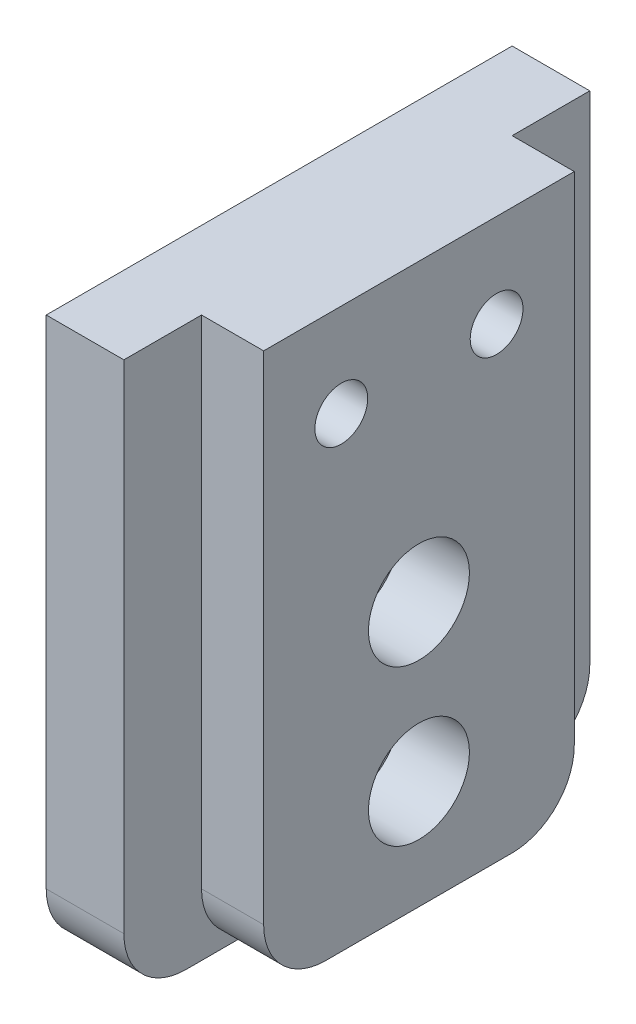
ISO-10303-21;
HEADER;
FILE_DESCRIPTION(('STEP AP214'),'2;1');
FILE_NAME('part.step','',(''),(''),'','','');
FILE_SCHEMA(('AUTOMOTIVE_DESIGN { 1 0 10303 214 1 1 1 1 }'));
ENDSEC;
DATA;
#1=APPLICATION_CONTEXT('core data for automotive mechanical design processes');
#2=APPLICATION_PROTOCOL_DEFINITION('international standard','automotive_design',2000,#1);
#3=PRODUCT_CONTEXT('',#1,'mechanical');
#4=PRODUCT('Part','Part','',(#3));
#5=PRODUCT_RELATED_PRODUCT_CATEGORY('part','',(#4));
#6=PRODUCT_DEFINITION_FORMATION('','',#4);
#7=PRODUCT_DEFINITION_CONTEXT('part definition',#1,'design');
#8=PRODUCT_DEFINITION('design','',#6,#7);
#9=PRODUCT_DEFINITION_SHAPE('','',#8);
#10=(LENGTH_UNIT() NAMED_UNIT(*) SI_UNIT(.MILLI.,.METRE.));
#11=(NAMED_UNIT(*) PLANE_ANGLE_UNIT() SI_UNIT($,.RADIAN.));
#12=(NAMED_UNIT(*) SI_UNIT($,.STERADIAN.) SOLID_ANGLE_UNIT());
#13=UNCERTAINTY_MEASURE_WITH_UNIT(LENGTH_MEASURE(1.E-05),#10,'distance_accuracy_value','');
#14=(GEOMETRIC_REPRESENTATION_CONTEXT(3) GLOBAL_UNCERTAINTY_ASSIGNED_CONTEXT((#13)) GLOBAL_UNIT_ASSIGNED_CONTEXT((#10,
#11,#12)) REPRESENTATION_CONTEXT('',''));
#15=CARTESIAN_POINT('',(0.,0.,0.));
#16=DIRECTION('',(0.,0.,1.));
#17=DIRECTION('',(1.,0.,0.));
#18=AXIS2_PLACEMENT_3D('',#15,#16,#17);
#19=CARTESIAN_POINT('',(0.,0.,0.));
#20=DIRECTION('',(1.,0.,0.));
#21=DIRECTION('',(0.,0.,-1.));
#22=AXIS2_PLACEMENT_3D('',#19,#20,#21);
#23=PLANE('',#22);
#24=DIRECTION('',(0.,1.,0.));
#25=VECTOR('',#24,1.);
#26=CARTESIAN_POINT('',(0.,-30.,-10.));
#27=LINE('',#26,#25);
#28=CARTESIAN_POINT('',(0.,-26.,-10.));
#29=VERTEX_POINT('',#28);
#30=CARTESIAN_POINT('',(0.,6.,-10.));
#31=VERTEX_POINT('',#30);
#32=EDGE_CURVE('E145',#29,#31,#27,.T.);
#33=ORIENTED_EDGE('',*,*,#32,.T.);
#34=DIRECTION('',(0.,0.,1.));
#35=VECTOR('',#34,1.);
#36=CARTESIAN_POINT('',(0.,6.,10.));
#37=LINE('',#36,#35);
#38=CARTESIAN_POINT('',(0.,6.,10.));
#39=VERTEX_POINT('',#38);
#40=EDGE_CURVE('E149',#31,#39,#37,.T.);
#41=ORIENTED_EDGE('',*,*,#40,.T.);
#42=DIRECTION('',(0.,1.,0.));
#43=VECTOR('',#42,1.);
#44=CARTESIAN_POINT('',(0.,-30.,10.));
#45=LINE('',#44,#43);
#46=CARTESIAN_POINT('',(0.,-26.,10.));
#47=VERTEX_POINT('',#46);
#48=EDGE_CURVE('E134',#47,#39,#45,.T.);
#49=ORIENTED_EDGE('',*,*,#48,.F.);
#50=CARTESIAN_POINT('',(0.,-26.,6.));
#51=DIRECTION('',(1.,0.,0.));
#52=DIRECTION('',(0.,0.,-1.));
#53=AXIS2_PLACEMENT_3D('',#50,#51,#52);
#54=CIRCLE('',#53,4.);
#55=CARTESIAN_POINT('',(0.,-30.,6.));
#56=VERTEX_POINT('',#55);
#57=EDGE_CURVE('E286',#47,#56,#54,.T.);
#58=ORIENTED_EDGE('',*,*,#57,.T.);
#59=DIRECTION('',(0.,0.,-1.));
#60=VECTOR('',#59,1.);
#61=CARTESIAN_POINT('',(0.,-30.,-10.));
#62=LINE('',#61,#60);
#63=CARTESIAN_POINT('',(0.,-30.,-6.));
#64=VERTEX_POINT('',#63);
#65=EDGE_CURVE('E172',#56,#64,#62,.T.);
#66=ORIENTED_EDGE('',*,*,#65,.T.);
#67=CARTESIAN_POINT('',(0.,-26.,-6.));
#68=DIRECTION('',(1.,0.,0.));
#69=DIRECTION('',(0.,0.,-1.));
#70=AXIS2_PLACEMENT_3D('',#67,#68,#69);
#71=CIRCLE('',#70,4.);
#72=EDGE_CURVE('E288',#64,#29,#71,.T.);
#73=ORIENTED_EDGE('',*,*,#72,.T.);
#74=EDGE_LOOP('',(#33,#41,#49,#58,#66,#73));
#75=FACE_BOUND('',#74,.T.);
#76=CARTESIAN_POINT('',(0.,0.,5.));
#77=DIRECTION('',(-1.,0.,0.));
#78=DIRECTION('',(0.,0.,1.));
#79=AXIS2_PLACEMENT_3D('',#76,#77,#78);
#80=CIRCLE('',#79,1.7);
#81=CARTESIAN_POINT('',(0.,0.,6.69999999999999));
#82=VERTEX_POINT('',#81);
#83=EDGE_CURVE('E157',#82,#82,#80,.T.);
#84=ORIENTED_EDGE('',*,*,#83,.T.);
#85=EDGE_LOOP('',(#84));
#86=FACE_BOUND('',#85,.T.);
#87=CARTESIAN_POINT('',(0.,0.,-5.));
#88=DIRECTION('',(-1.,0.,0.));
#89=DIRECTION('',(0.,0.,1.));
#90=AXIS2_PLACEMENT_3D('',#87,#88,#89);
#91=CIRCLE('',#90,1.7);
#92=CARTESIAN_POINT('',(0.,0.,-3.3));
#93=VERTEX_POINT('',#92);
#94=EDGE_CURVE('E45',#93,#93,#91,.T.);
#95=ORIENTED_EDGE('',*,*,#94,.T.);
#96=EDGE_LOOP('',(#95));
#97=FACE_BOUND('',#96,.T.);
#98=CARTESIAN_POINT('',(0.,-13.,0.));
#99=DIRECTION('',(1.,0.,0.));
#100=DIRECTION('',(0.,0.,-1.));
#101=AXIS2_PLACEMENT_3D('',#98,#99,#100);
#102=CIRCLE('',#101,3.25);
#103=CARTESIAN_POINT('',(0.,-13.,-3.25));
#104=VERTEX_POINT('',#103);
#105=EDGE_CURVE('E216',#104,#104,#102,.T.);
#106=ORIENTED_EDGE('',*,*,#105,.F.);
#107=EDGE_LOOP('',(#106));
#108=FACE_BOUND('',#107,.T.);
#109=CARTESIAN_POINT('',(0.,-23.,0.));
#110=DIRECTION('',(1.,0.,0.));
#111=DIRECTION('',(0.,0.,-1.));
#112=AXIS2_PLACEMENT_3D('',#109,#110,#111);
#113=CIRCLE('',#112,3.25);
#114=CARTESIAN_POINT('',(0.,-23.,-3.25));
#115=VERTEX_POINT('',#114);
#116=EDGE_CURVE('E204',#115,#115,#113,.T.);
#117=ORIENTED_EDGE('',*,*,#116,.F.);
#118=EDGE_LOOP('',(#117));
#119=FACE_BOUND('',#118,.T.);
#120=ADVANCED_FACE('F41',(#75,#86,#97,#108,#119),#23,.T.);
#121=CARTESIAN_POINT('',(0.,-23.,0.));
#122=DIRECTION('',(1.,0.,0.));
#123=DIRECTION('',(0.,0.,-1.));
#124=AXIS2_PLACEMENT_3D('',#121,#122,#123);
#125=CYLINDRICAL_SURFACE('',#124,1.7);
#126=CARTESIAN_POINT('',(-9.,-23.,0.));
#127=DIRECTION('',(1.,0.,0.));
#128=DIRECTION('',(0.,0.,-1.));
#129=AXIS2_PLACEMENT_3D('',#126,#127,#128);
#130=CIRCLE('',#129,1.7);
#131=CARTESIAN_POINT('',(-9.,-23.,-1.7));
#132=VERTEX_POINT('',#131);
#133=EDGE_CURVE('E195',#132,#132,#130,.T.);
#134=ORIENTED_EDGE('',*,*,#133,.F.);
#135=EDGE_LOOP('',(#134));
#136=FACE_BOUND('',#135,.T.);
#137=CARTESIAN_POINT('',(-4.5,-23.,0.));
#138=DIRECTION('',(1.,0.,0.));
#139=DIRECTION('',(0.,0.,-1.));
#140=AXIS2_PLACEMENT_3D('',#137,#138,#139);
#141=CIRCLE('',#140,1.7);
#142=CARTESIAN_POINT('',(-4.5,-23.,-1.7));
#143=VERTEX_POINT('',#142);
#144=EDGE_CURVE('E198',#143,#143,#141,.T.);
#145=ORIENTED_EDGE('',*,*,#144,.T.);
#146=EDGE_LOOP('',(#145));
#147=FACE_BOUND('',#146,.T.);
#148=ADVANCED_FACE('F333',(#136,#147),#125,.F.);
#149=CARTESIAN_POINT('',(-4.5,-21.3,0.));
#150=DIRECTION('',(-1.,0.,0.));
#151=DIRECTION('',(0.,0.,1.));
#152=AXIS2_PLACEMENT_3D('',#149,#150,#151);
#153=PLANE('',#152);
#154=ORIENTED_EDGE('',*,*,#144,.F.);
#155=EDGE_LOOP('',(#154));
#156=FACE_BOUND('',#155,.T.);
#157=CARTESIAN_POINT('',(-4.5,-23.,0.));
#158=DIRECTION('',(1.,0.,0.));
#159=DIRECTION('',(0.,0.,-1.));
#160=AXIS2_PLACEMENT_3D('',#157,#158,#159);
#161=CIRCLE('',#160,3.25);
#162=CARTESIAN_POINT('',(-4.5,-23.,-3.25));
#163=VERTEX_POINT('',#162);
#164=EDGE_CURVE('E201',#163,#163,#161,.T.);
#165=ORIENTED_EDGE('',*,*,#164,.T.);
#166=EDGE_LOOP('',(#165));
#167=FACE_BOUND('',#166,.T.);
#168=ADVANCED_FACE('F335',(#156,#167),#153,.F.);
#169=CARTESIAN_POINT('',(0.,-23.,0.));
#170=DIRECTION('',(1.,0.,0.));
#171=DIRECTION('',(0.,0.,-1.));
#172=AXIS2_PLACEMENT_3D('',#169,#170,#171);
#173=CYLINDRICAL_SURFACE('',#172,3.25);
#174=ORIENTED_EDGE('',*,*,#164,.F.);
#175=EDGE_LOOP('',(#174));
#176=FACE_BOUND('',#175,.T.);
#177=ORIENTED_EDGE('',*,*,#116,.T.);
#178=EDGE_LOOP('',(#177));
#179=FACE_BOUND('',#178,.T.);
#180=ADVANCED_FACE('F342',(#176,#179),#173,.F.);
#181=CARTESIAN_POINT('',(0.,-13.,0.));
#182=DIRECTION('',(1.,0.,0.));
#183=DIRECTION('',(0.,0.,-1.));
#184=AXIS2_PLACEMENT_3D('',#181,#182,#183);
#185=CYLINDRICAL_SURFACE('',#184,1.7);
#186=CARTESIAN_POINT('',(-9.,-13.,0.));
#187=DIRECTION('',(1.,0.,0.));
#188=DIRECTION('',(0.,0.,-1.));
#189=AXIS2_PLACEMENT_3D('',#186,#187,#188);
#190=CIRCLE('',#189,1.7);
#191=CARTESIAN_POINT('',(-9.,-13.,-1.7));
#192=VERTEX_POINT('',#191);
#193=EDGE_CURVE('E207',#192,#192,#190,.T.);
#194=ORIENTED_EDGE('',*,*,#193,.F.);
#195=EDGE_LOOP('',(#194));
#196=FACE_BOUND('',#195,.T.);
#197=CARTESIAN_POINT('',(-4.5,-13.,0.));
#198=DIRECTION('',(1.,0.,0.));
#199=DIRECTION('',(0.,0.,-1.));
#200=AXIS2_PLACEMENT_3D('',#197,#198,#199);
#201=CIRCLE('',#200,1.7);
#202=CARTESIAN_POINT('',(-4.5,-13.,-1.7));
#203=VERTEX_POINT('',#202);
#204=EDGE_CURVE('E210',#203,#203,#201,.T.);
#205=ORIENTED_EDGE('',*,*,#204,.T.);
#206=EDGE_LOOP('',(#205));
#207=FACE_BOUND('',#206,.T.);
#208=ADVANCED_FACE('F351',(#196,#207),#185,.F.);
#209=CARTESIAN_POINT('',(-4.5,-11.3,0.));
#210=DIRECTION('',(-1.,0.,0.));
#211=DIRECTION('',(0.,0.,1.));
#212=AXIS2_PLACEMENT_3D('',#209,#210,#211);
#213=PLANE('',#212);
#214=ORIENTED_EDGE('',*,*,#204,.F.);
#215=EDGE_LOOP('',(#214));
#216=FACE_BOUND('',#215,.T.);
#217=CARTESIAN_POINT('',(-4.5,-13.,0.));
#218=DIRECTION('',(1.,0.,0.));
#219=DIRECTION('',(0.,0.,-1.));
#220=AXIS2_PLACEMENT_3D('',#217,#218,#219);
#221=CIRCLE('',#220,3.25);
#222=CARTESIAN_POINT('',(-4.5,-13.,-3.25));
#223=VERTEX_POINT('',#222);
#224=EDGE_CURVE('E213',#223,#223,#221,.T.);
#225=ORIENTED_EDGE('',*,*,#224,.T.);
#226=EDGE_LOOP('',(#225));
#227=FACE_BOUND('',#226,.T.);
#228=ADVANCED_FACE('F355',(#216,#227),#213,.F.);
#229=CARTESIAN_POINT('',(0.,-13.,0.));
#230=DIRECTION('',(1.,0.,0.));
#231=DIRECTION('',(0.,0.,-1.));
#232=AXIS2_PLACEMENT_3D('',#229,#230,#231);
#233=CYLINDRICAL_SURFACE('',#232,3.25);
#234=ORIENTED_EDGE('',*,*,#224,.F.);
#235=EDGE_LOOP('',(#234));
#236=FACE_BOUND('',#235,.T.);
#237=ORIENTED_EDGE('',*,*,#105,.T.);
#238=EDGE_LOOP('',(#237));
#239=FACE_BOUND('',#238,.T.);
#240=ADVANCED_FACE('F359',(#236,#239),#233,.F.);
#241=CARTESIAN_POINT('',(-9.,0.,5.));
#242=DIRECTION('',(-1.,0.,0.));
#243=DIRECTION('',(0.,0.,1.));
#244=AXIS2_PLACEMENT_3D('',#241,#242,#243);
#245=CYLINDRICAL_SURFACE('',#244,3.25);
#246=CARTESIAN_POINT('',(-4.5,0.,5.));
#247=DIRECTION('',(-1.,0.,0.));
#248=DIRECTION('',(0.,0.,1.));
#249=AXIS2_PLACEMENT_3D('',#246,#247,#248);
#250=CIRCLE('',#249,3.25);
#251=CARTESIAN_POINT('',(-4.5,0.,8.25));
#252=VERTEX_POINT('',#251);
#253=EDGE_CURVE('E222',#252,#252,#250,.T.);
#254=ORIENTED_EDGE('',*,*,#253,.F.);
#255=EDGE_LOOP('',(#254));
#256=FACE_BOUND('',#255,.T.);
#257=CARTESIAN_POINT('',(-9.,0.,5.));
#258=DIRECTION('',(-1.,0.,0.));
#259=DIRECTION('',(0.,0.,1.));
#260=AXIS2_PLACEMENT_3D('',#257,#258,#259);
#261=CIRCLE('',#260,3.25);
#262=CARTESIAN_POINT('',(-9.,0.,8.25));
#263=VERTEX_POINT('',#262);
#264=EDGE_CURVE('E225',#263,#263,#261,.T.);
#265=ORIENTED_EDGE('',*,*,#264,.T.);
#266=EDGE_LOOP('',(#265));
#267=FACE_BOUND('',#266,.T.);
#268=ADVANCED_FACE('F363',(#256,#267),#245,.F.);
#269=CARTESIAN_POINT('',(-4.5,1.7,5.));
#270=DIRECTION('',(1.,0.,0.));
#271=DIRECTION('',(0.,0.,-1.));
#272=AXIS2_PLACEMENT_3D('',#269,#270,#271);
#273=PLANE('',#272);
#274=CARTESIAN_POINT('',(-4.5,0.,5.));
#275=DIRECTION('',(-1.,0.,0.));
#276=DIRECTION('',(0.,0.,1.));
#277=AXIS2_PLACEMENT_3D('',#274,#275,#276);
#278=CIRCLE('',#277,1.7);
#279=CARTESIAN_POINT('',(-4.5,0.,6.69999999999999));
#280=VERTEX_POINT('',#279);
#281=EDGE_CURVE('E219',#280,#280,#278,.T.);
#282=ORIENTED_EDGE('',*,*,#281,.F.);
#283=EDGE_LOOP('',(#282));
#284=FACE_BOUND('',#283,.T.);
#285=ORIENTED_EDGE('',*,*,#253,.T.);
#286=EDGE_LOOP('',(#285));
#287=FACE_BOUND('',#286,.T.);
#288=ADVANCED_FACE('F367',(#284,#287),#273,.F.);
#289=CARTESIAN_POINT('',(-9.,0.,5.));
#290=DIRECTION('',(-1.,0.,0.));
#291=DIRECTION('',(0.,0.,1.));
#292=AXIS2_PLACEMENT_3D('',#289,#290,#291);
#293=CYLINDRICAL_SURFACE('',#292,1.7);
#294=ORIENTED_EDGE('',*,*,#83,.F.);
#295=EDGE_LOOP('',(#294));
#296=FACE_BOUND('',#295,.T.);
#297=ORIENTED_EDGE('',*,*,#281,.T.);
#298=EDGE_LOOP('',(#297));
#299=FACE_BOUND('',#298,.T.);
#300=ADVANCED_FACE('F238',(#296,#299),#293,.F.);
#301=CARTESIAN_POINT('',(-9.,0.,-5.));
#302=DIRECTION('',(-1.,0.,0.));
#303=DIRECTION('',(0.,0.,1.));
#304=AXIS2_PLACEMENT_3D('',#301,#302,#303);
#305=CYLINDRICAL_SURFACE('',#304,3.25);
#306=CARTESIAN_POINT('',(-4.5,0.,-5.));
#307=DIRECTION('',(-1.,0.,0.));
#308=DIRECTION('',(0.,0.,1.));
#309=AXIS2_PLACEMENT_3D('',#306,#307,#308);
#310=CIRCLE('',#309,3.25);
#311=CARTESIAN_POINT('',(-4.5,0.,-1.75));
#312=VERTEX_POINT('',#311);
#313=EDGE_CURVE('E50',#312,#312,#310,.T.);
#314=ORIENTED_EDGE('',*,*,#313,.F.);
#315=EDGE_LOOP('',(#314));
#316=FACE_BOUND('',#315,.T.);
#317=CARTESIAN_POINT('',(-9.,0.,-5.));
#318=DIRECTION('',(-1.,0.,0.));
#319=DIRECTION('',(0.,0.,1.));
#320=AXIS2_PLACEMENT_3D('',#317,#318,#319);
#321=CIRCLE('',#320,3.25);
#322=CARTESIAN_POINT('',(-9.,0.,-1.75));
#323=VERTEX_POINT('',#322);
#324=EDGE_CURVE('E11',#323,#323,#321,.T.);
#325=ORIENTED_EDGE('',*,*,#324,.T.);
#326=EDGE_LOOP('',(#325));
#327=FACE_BOUND('',#326,.T.);
#328=ADVANCED_FACE('F235',(#316,#327),#305,.F.);
#329=CARTESIAN_POINT('',(-4.5,1.7,-5.));
#330=DIRECTION('',(1.,0.,0.));
#331=DIRECTION('',(0.,0.,-1.));
#332=AXIS2_PLACEMENT_3D('',#329,#330,#331);
#333=PLANE('',#332);
#334=CARTESIAN_POINT('',(-4.5,0.,-5.));
#335=DIRECTION('',(-1.,0.,0.));
#336=DIRECTION('',(0.,0.,1.));
#337=AXIS2_PLACEMENT_3D('',#334,#335,#336);
#338=CIRCLE('',#337,1.7);
#339=CARTESIAN_POINT('',(-4.5,0.,-3.3));
#340=VERTEX_POINT('',#339);
#341=EDGE_CURVE('E228',#340,#340,#338,.T.);
#342=ORIENTED_EDGE('',*,*,#341,.F.);
#343=EDGE_LOOP('',(#342));
#344=FACE_BOUND('',#343,.T.);
#345=ORIENTED_EDGE('',*,*,#313,.T.);
#346=EDGE_LOOP('',(#345));
#347=FACE_BOUND('',#346,.T.);
#348=ADVANCED_FACE('F233',(#344,#347),#333,.F.);
#349=CARTESIAN_POINT('',(-9.,0.,-5.));
#350=DIRECTION('',(-1.,0.,0.));
#351=DIRECTION('',(0.,0.,1.));
#352=AXIS2_PLACEMENT_3D('',#349,#350,#351);
#353=CYLINDRICAL_SURFACE('',#352,1.7);
#354=ORIENTED_EDGE('',*,*,#94,.F.);
#355=EDGE_LOOP('',(#354));
#356=FACE_BOUND('',#355,.T.);
#357=ORIENTED_EDGE('',*,*,#341,.T.);
#358=EDGE_LOOP('',(#357));
#359=FACE_BOUND('',#358,.T.);
#360=ADVANCED_FACE('F323',(#356,#359),#353,.F.);
#361=CARTESIAN_POINT('',(-9.,-30.,15.));
#362=DIRECTION('',(0.,0.,1.));
#363=DIRECTION('',(1.,0.,0.));
#364=AXIS2_PLACEMENT_3D('',#361,#362,#363);
#365=PLANE('',#364);
#366=DIRECTION('',(0.,1.,0.));
#367=VECTOR('',#366,1.);
#368=CARTESIAN_POINT('',(-9.,-30.,15.));
#369=LINE('',#368,#367);
#370=CARTESIAN_POINT('',(-9.,-26.,15.));
#371=VERTEX_POINT('',#370);
#372=CARTESIAN_POINT('',(-9.,6.,15.));
#373=VERTEX_POINT('',#372);
#374=EDGE_CURVE('E294',#371,#373,#369,.T.);
#375=ORIENTED_EDGE('',*,*,#374,.F.);
#376=DIRECTION('',(1.,0.,0.));
#377=VECTOR('',#376,1.);
#378=CARTESIAN_POINT('',(-4.,-26.,15.));
#379=LINE('',#378,#377);
#380=CARTESIAN_POINT('',(-4.,-26.,15.));
#381=VERTEX_POINT('',#380);
#382=EDGE_CURVE('E267',#371,#381,#379,.T.);
#383=ORIENTED_EDGE('',*,*,#382,.T.);
#384=DIRECTION('',(0.,1.,0.));
#385=VECTOR('',#384,1.);
#386=CARTESIAN_POINT('',(-4.,-30.,15.));
#387=LINE('',#386,#385);
#388=CARTESIAN_POINT('',(-4.,6.,15.));
#389=VERTEX_POINT('',#388);
#390=EDGE_CURVE('E296',#381,#389,#387,.T.);
#391=ORIENTED_EDGE('',*,*,#390,.T.);
#392=DIRECTION('',(-1.,0.,0.));
#393=VECTOR('',#392,1.);
#394=CARTESIAN_POINT('',(-9.,6.,15.));
#395=LINE('',#394,#393);
#396=EDGE_CURVE('E191',#389,#373,#395,.T.);
#397=ORIENTED_EDGE('',*,*,#396,.T.);
#398=EDGE_LOOP('',(#375,#383,#391,#397));
#399=FACE_BOUND('',#398,.T.);
#400=ADVANCED_FACE('F321',(#399),#365,.T.);
#401=CARTESIAN_POINT('',(-4.,-30.,-15.));
#402=DIRECTION('',(0.,0.,-1.));
#403=DIRECTION('',(-1.,0.,0.));
#404=AXIS2_PLACEMENT_3D('',#401,#402,#403);
#405=PLANE('',#404);
#406=DIRECTION('',(0.,1.,0.));
#407=VECTOR('',#406,1.);
#408=CARTESIAN_POINT('',(-4.,-30.,-15.));
#409=LINE('',#408,#407);
#410=CARTESIAN_POINT('',(-4.,-26.,-15.));
#411=VERTEX_POINT('',#410);
#412=CARTESIAN_POINT('',(-4.,6.,-15.));
#413=VERTEX_POINT('',#412);
#414=EDGE_CURVE('E58',#411,#413,#409,.T.);
#415=ORIENTED_EDGE('',*,*,#414,.F.);
#416=DIRECTION('',(-1.,0.,0.));
#417=VECTOR('',#416,1.);
#418=CARTESIAN_POINT('',(-9.,-26.,-15.));
#419=LINE('',#418,#417);
#420=CARTESIAN_POINT('',(-9.,-26.,-15.));
#421=VERTEX_POINT('',#420);
#422=EDGE_CURVE('E272',#411,#421,#419,.T.);
#423=ORIENTED_EDGE('',*,*,#422,.T.);
#424=DIRECTION('',(0.,1.,0.));
#425=VECTOR('',#424,1.);
#426=CARTESIAN_POINT('',(-9.,-30.,-15.));
#427=LINE('',#426,#425);
#428=CARTESIAN_POINT('',(-9.,6.,-15.));
#429=VERTEX_POINT('',#428);
#430=EDGE_CURVE('E292',#421,#429,#427,.T.);
#431=ORIENTED_EDGE('',*,*,#430,.T.);
#432=DIRECTION('',(1.,0.,0.));
#433=VECTOR('',#432,1.);
#434=CARTESIAN_POINT('',(-4.,6.,-15.));
#435=LINE('',#434,#433);
#436=EDGE_CURVE('E185',#429,#413,#435,.T.);
#437=ORIENTED_EDGE('',*,*,#436,.T.);
#438=EDGE_LOOP('',(#415,#423,#431,#437));
#439=FACE_BOUND('',#438,.T.);
#440=ADVANCED_FACE('F317',(#439),#405,.T.);
#441=CARTESIAN_POINT('',(0.,6.,10.));
#442=DIRECTION('',(0.,-1.,0.));
#443=DIRECTION('',(0.,0.,-1.));
#444=AXIS2_PLACEMENT_3D('',#441,#442,#443);
#445=PLANE('',#444);
#446=ORIENTED_EDGE('',*,*,#40,.F.);
#447=DIRECTION('',(-1.,0.,0.));
#448=VECTOR('',#447,1.);
#449=CARTESIAN_POINT('',(0.,6.,-10.));
#450=LINE('',#449,#448);
#451=CARTESIAN_POINT('',(-4.,6.,-10.));
#452=VERTEX_POINT('',#451);
#453=EDGE_CURVE('E65',#31,#452,#450,.T.);
#454=ORIENTED_EDGE('',*,*,#453,.T.);
#455=DIRECTION('',(0.,0.,1.));
#456=VECTOR('',#455,1.);
#457=CARTESIAN_POINT('',(-4.,6.,-10.));
#458=LINE('',#457,#456);
#459=EDGE_CURVE('E183',#413,#452,#458,.T.);
#460=ORIENTED_EDGE('',*,*,#459,.F.);
#461=ORIENTED_EDGE('',*,*,#436,.F.);
#462=DIRECTION('',(0.,0.,-1.));
#463=VECTOR('',#462,1.);
#464=CARTESIAN_POINT('',(-9.,6.,-15.));
#465=LINE('',#464,#463);
#466=EDGE_CURVE('E188',#373,#429,#465,.T.);
#467=ORIENTED_EDGE('',*,*,#466,.F.);
#468=ORIENTED_EDGE('',*,*,#396,.F.);
#469=DIRECTION('',(0.,0.,1.));
#470=VECTOR('',#469,1.);
#471=CARTESIAN_POINT('',(-4.,6.,15.));
#472=LINE('',#471,#470);
#473=CARTESIAN_POINT('',(-4.,6.,10.));
#474=VERTEX_POINT('',#473);
#475=EDGE_CURVE('E152',#474,#389,#472,.T.);
#476=ORIENTED_EDGE('',*,*,#475,.F.);
#477=DIRECTION('',(-1.,0.,0.));
#478=VECTOR('',#477,1.);
#479=CARTESIAN_POINT('',(0.,6.,10.));
#480=LINE('',#479,#478);
#481=EDGE_CURVE('E138',#39,#474,#480,.T.);
#482=ORIENTED_EDGE('',*,*,#481,.F.);
#483=EDGE_LOOP('',(#446,#454,#460,#461,#467,#468,#476,#482));
#484=FACE_BOUND('',#483,.T.);
#485=ADVANCED_FACE('F148',(#484),#445,.F.);
#486=CARTESIAN_POINT('',(-4.,-26.,-11.));
#487=DIRECTION('',(1.,0.,0.));
#488=DIRECTION('',(0.,0.,-1.));
#489=AXIS2_PLACEMENT_3D('',#486,#487,#488);
#490=CYLINDRICAL_SURFACE('',#489,4.);
#491=CARTESIAN_POINT('',(-4.,-26.,-11.));
#492=DIRECTION('',(1.,0.,0.));
#493=DIRECTION('',(0.,0.,-1.));
#494=AXIS2_PLACEMENT_3D('',#491,#492,#493);
#495=CIRCLE('',#494,4.);
#496=CARTESIAN_POINT('',(-4.,-30.,-11.));
#497=VERTEX_POINT('',#496);
#498=EDGE_CURVE('E641',#497,#411,#495,.T.);
#499=ORIENTED_EDGE('',*,*,#498,.F.);
#500=DIRECTION('',(-1.,0.,0.));
#501=VECTOR('',#500,1.);
#502=CARTESIAN_POINT('',(-4.,-30.,-11.));
#503=LINE('',#502,#501);
#504=CARTESIAN_POINT('',(-9.,-30.,-11.));
#505=VERTEX_POINT('',#504);
#506=EDGE_CURVE('E284',#505,#497,#503,.F.);
#507=ORIENTED_EDGE('',*,*,#506,.F.);
#508=CARTESIAN_POINT('',(-9.,-26.,-11.));
#509=DIRECTION('',(-1.,0.,0.));
#510=DIRECTION('',(0.,0.,1.));
#511=AXIS2_PLACEMENT_3D('',#508,#509,#510);
#512=CIRCLE('',#511,4.);
#513=EDGE_CURVE('E259',#421,#505,#512,.T.);
#514=ORIENTED_EDGE('',*,*,#513,.F.);
#515=ORIENTED_EDGE('',*,*,#422,.F.);
#516=EDGE_LOOP('',(#499,#507,#514,#515));
#517=FACE_BOUND('',#516,.T.);
#518=ADVANCED_FACE('F246',(#517),#490,.T.);
#519=CARTESIAN_POINT('',(-9.,-30.,-15.));
#520=DIRECTION('',(-1.,0.,0.));
#521=DIRECTION('',(0.,0.,1.));
#522=AXIS2_PLACEMENT_3D('',#519,#520,#521);
#523=PLANE('',#522);
#524=ORIENTED_EDGE('',*,*,#324,.F.);
#525=EDGE_LOOP('',(#524));
#526=FACE_BOUND('',#525,.T.);
#527=ORIENTED_EDGE('',*,*,#264,.F.);
#528=EDGE_LOOP('',(#527));
#529=FACE_BOUND('',#528,.T.);
#530=ORIENTED_EDGE('',*,*,#193,.T.);
#531=EDGE_LOOP('',(#530));
#532=FACE_BOUND('',#531,.T.);
#533=ORIENTED_EDGE('',*,*,#133,.T.);
#534=EDGE_LOOP('',(#533));
#535=FACE_BOUND('',#534,.T.);
#536=DIRECTION('',(0.,0.,1.));
#537=VECTOR('',#536,1.);
#538=CARTESIAN_POINT('',(-9.,-30.,-15.));
#539=LINE('',#538,#537);
#540=CARTESIAN_POINT('',(-9.,-30.,11.));
#541=VERTEX_POINT('',#540);
#542=EDGE_CURVE('E177',#505,#541,#539,.T.);
#543=ORIENTED_EDGE('',*,*,#542,.T.);
#544=CARTESIAN_POINT('',(-9.,-26.,11.));
#545=DIRECTION('',(-1.,0.,0.));
#546=DIRECTION('',(0.,0.,1.));
#547=AXIS2_PLACEMENT_3D('',#544,#545,#546);
#548=CIRCLE('',#547,4.);
#549=EDGE_CURVE('E256',#541,#371,#548,.T.);
#550=ORIENTED_EDGE('',*,*,#549,.T.);
#551=ORIENTED_EDGE('',*,*,#374,.T.);
#552=ORIENTED_EDGE('',*,*,#466,.T.);
#553=ORIENTED_EDGE('',*,*,#430,.F.);
#554=ORIENTED_EDGE('',*,*,#513,.T.);
#555=EDGE_LOOP('',(#543,#550,#551,#552,#553,#554));
#556=FACE_BOUND('',#555,.T.);
#557=ADVANCED_FACE('F242',(#526,#529,#532,#535,#556),#523,.T.);
#558=CARTESIAN_POINT('',(-9.,-26.,11.));
#559=DIRECTION('',(-1.,0.,0.));
#560=DIRECTION('',(0.,0.,1.));
#561=AXIS2_PLACEMENT_3D('',#558,#559,#560);
#562=CYLINDRICAL_SURFACE('',#561,4.);
#563=ORIENTED_EDGE('',*,*,#549,.F.);
#564=DIRECTION('',(1.,0.,0.));
#565=VECTOR('',#564,1.);
#566=CARTESIAN_POINT('',(-9.,-30.,11.));
#567=LINE('',#566,#565);
#568=CARTESIAN_POINT('',(-4.,-30.,11.));
#569=VERTEX_POINT('',#568);
#570=EDGE_CURVE('E265',#569,#541,#567,.F.);
#571=ORIENTED_EDGE('',*,*,#570,.F.);
#572=CARTESIAN_POINT('',(-4.,-26.,11.));
#573=DIRECTION('',(1.,0.,0.));
#574=DIRECTION('',(0.,0.,-1.));
#575=AXIS2_PLACEMENT_3D('',#572,#573,#574);
#576=CIRCLE('',#575,4.);
#577=EDGE_CURVE('E270',#381,#569,#576,.T.);
#578=ORIENTED_EDGE('',*,*,#577,.F.);
#579=ORIENTED_EDGE('',*,*,#382,.F.);
#580=EDGE_LOOP('',(#563,#571,#578,#579));
#581=FACE_BOUND('',#580,.T.);
#582=ADVANCED_FACE('F245',(#581),#562,.T.);
#583=CARTESIAN_POINT('',(0.,0.,10.));
#584=DIRECTION('',(0.,0.,-1.));
#585=DIRECTION('',(-1.,0.,0.));
#586=AXIS2_PLACEMENT_3D('',#583,#584,#585);
#587=PLANE('',#586);
#588=ORIENTED_EDGE('',*,*,#48,.T.);
#589=ORIENTED_EDGE('',*,*,#481,.T.);
#590=DIRECTION('',(0.,1.,0.));
#591=VECTOR('',#590,1.);
#592=CARTESIAN_POINT('',(-4.,-30.,10.));
#593=LINE('',#592,#591);
#594=CARTESIAN_POINT('',(-4.,-26.,10.));
#595=VERTEX_POINT('',#594);
#596=EDGE_CURVE('E144',#595,#474,#593,.T.);
#597=ORIENTED_EDGE('',*,*,#596,.F.);
#598=DIRECTION('',(1.,0.,0.));
#599=VECTOR('',#598,1.);
#600=CARTESIAN_POINT('',(0.,-26.,10.));
#601=LINE('',#600,#599);
#602=EDGE_CURVE('E141',#595,#47,#601,.T.);
#603=ORIENTED_EDGE('',*,*,#602,.T.);
#604=EDGE_LOOP('',(#588,#589,#597,#603));
#605=FACE_BOUND('',#604,.T.);
#606=ADVANCED_FACE('F136',(#605),#587,.F.);
#607=CARTESIAN_POINT('',(0.,0.,-10.));
#608=DIRECTION('',(0.,0.,-1.));
#609=DIRECTION('',(-1.,0.,0.));
#610=AXIS2_PLACEMENT_3D('',#607,#608,#609);
#611=PLANE('',#610);
#612=ORIENTED_EDGE('',*,*,#453,.F.);
#613=ORIENTED_EDGE('',*,*,#32,.F.);
#614=DIRECTION('',(-1.,0.,0.));
#615=VECTOR('',#614,1.);
#616=CARTESIAN_POINT('',(-4.,-26.,-10.));
#617=LINE('',#616,#615);
#618=CARTESIAN_POINT('',(-4.,-26.,-10.));
#619=VERTEX_POINT('',#618);
#620=EDGE_CURVE('E268',#29,#619,#617,.T.);
#621=ORIENTED_EDGE('',*,*,#620,.T.);
#622=DIRECTION('',(0.,1.,0.));
#623=VECTOR('',#622,1.);
#624=CARTESIAN_POINT('',(-4.,-30.,-10.));
#625=LINE('',#624,#623);
#626=EDGE_CURVE('E165',#619,#452,#625,.T.);
#627=ORIENTED_EDGE('',*,*,#626,.T.);
#628=EDGE_LOOP('',(#612,#613,#621,#627));
#629=FACE_BOUND('',#628,.T.);
#630=ADVANCED_FACE('F43',(#629),#611,.T.);
#631=CARTESIAN_POINT('',(-4.,-30.,-10.));
#632=DIRECTION('',(1.,0.,0.));
#633=DIRECTION('',(0.,0.,-1.));
#634=AXIS2_PLACEMENT_3D('',#631,#632,#633);
#635=PLANE('',#634);
#636=DIRECTION('',(0.,0.,-1.));
#637=VECTOR('',#636,1.);
#638=CARTESIAN_POINT('',(-4.,-30.,-10.));
#639=LINE('',#638,#637);
#640=CARTESIAN_POINT('',(-4.,-30.,-6.));
#641=VERTEX_POINT('',#640);
#642=EDGE_CURVE('E180',#641,#497,#639,.T.);
#643=ORIENTED_EDGE('',*,*,#642,.T.);
#644=ORIENTED_EDGE('',*,*,#498,.T.);
#645=ORIENTED_EDGE('',*,*,#414,.T.);
#646=ORIENTED_EDGE('',*,*,#459,.T.);
#647=ORIENTED_EDGE('',*,*,#626,.F.);
#648=CARTESIAN_POINT('',(-4.,-26.,-6.));
#649=DIRECTION('',(1.,0.,0.));
#650=DIRECTION('',(0.,0.,-1.));
#651=AXIS2_PLACEMENT_3D('',#648,#649,#650);
#652=CIRCLE('',#651,4.);
#653=EDGE_CURVE('E156',#619,#641,#652,.F.);
#654=ORIENTED_EDGE('',*,*,#653,.T.);
#655=EDGE_LOOP('',(#643,#644,#645,#646,#647,#654));
#656=FACE_BOUND('',#655,.T.);
#657=ADVANCED_FACE('F313',(#656),#635,.T.);
#658=CARTESIAN_POINT('',(0.,-30.,0.));
#659=DIRECTION('',(0.,1.,0.));
#660=DIRECTION('',(0.,0.,1.));
#661=AXIS2_PLACEMENT_3D('',#658,#659,#660);
#662=PLANE('',#661);
#663=ORIENTED_EDGE('',*,*,#65,.F.);
#664=DIRECTION('',(1.,0.,0.));
#665=VECTOR('',#664,1.);
#666=CARTESIAN_POINT('',(0.,-30.,6.));
#667=LINE('',#666,#665);
#668=CARTESIAN_POINT('',(-4.,-30.,6.));
#669=VERTEX_POINT('',#668);
#670=EDGE_CURVE('E278',#56,#669,#667,.F.);
#671=ORIENTED_EDGE('',*,*,#670,.T.);
#672=DIRECTION('',(0.,0.,-1.));
#673=VECTOR('',#672,1.);
#674=CARTESIAN_POINT('',(-4.,-30.,15.));
#675=LINE('',#674,#673);
#676=EDGE_CURVE('E175',#569,#669,#675,.T.);
#677=ORIENTED_EDGE('',*,*,#676,.F.);
#678=ORIENTED_EDGE('',*,*,#570,.T.);
#679=ORIENTED_EDGE('',*,*,#542,.F.);
#680=ORIENTED_EDGE('',*,*,#506,.T.);
#681=ORIENTED_EDGE('',*,*,#642,.F.);
#682=DIRECTION('',(-1.,0.,0.));
#683=VECTOR('',#682,1.);
#684=CARTESIAN_POINT('',(0.,-30.,-6.));
#685=LINE('',#684,#683);
#686=EDGE_CURVE('E282',#641,#64,#685,.F.);
#687=ORIENTED_EDGE('',*,*,#686,.T.);
#688=EDGE_LOOP('',(#663,#671,#677,#678,#679,#680,#681,#687));
#689=FACE_BOUND('',#688,.T.);
#690=ADVANCED_FACE('F307',(#689),#662,.F.);
#691=CARTESIAN_POINT('',(0.,-26.,-6.));
#692=DIRECTION('',(1.,0.,0.));
#693=DIRECTION('',(0.,0.,-1.));
#694=AXIS2_PLACEMENT_3D('',#691,#692,#693);
#695=CYLINDRICAL_SURFACE('',#694,4.);
#696=ORIENTED_EDGE('',*,*,#72,.F.);
#697=ORIENTED_EDGE('',*,*,#686,.F.);
#698=ORIENTED_EDGE('',*,*,#653,.F.);
#699=ORIENTED_EDGE('',*,*,#620,.F.);
#700=EDGE_LOOP('',(#696,#697,#698,#699));
#701=FACE_BOUND('',#700,.T.);
#702=ADVANCED_FACE('F311',(#701),#695,.T.);
#703=CARTESIAN_POINT('',(-4.,-30.,15.));
#704=DIRECTION('',(1.,0.,0.));
#705=DIRECTION('',(0.,0.,-1.));
#706=AXIS2_PLACEMENT_3D('',#703,#704,#705);
#707=PLANE('',#706);
#708=ORIENTED_EDGE('',*,*,#390,.F.);
#709=ORIENTED_EDGE('',*,*,#577,.T.);
#710=ORIENTED_EDGE('',*,*,#676,.T.);
#711=CARTESIAN_POINT('',(-4.,-26.,6.));
#712=DIRECTION('',(1.,0.,0.));
#713=DIRECTION('',(0.,0.,-1.));
#714=AXIS2_PLACEMENT_3D('',#711,#712,#713);
#715=CIRCLE('',#714,4.);
#716=EDGE_CURVE('E160',#669,#595,#715,.F.);
#717=ORIENTED_EDGE('',*,*,#716,.T.);
#718=ORIENTED_EDGE('',*,*,#596,.T.);
#719=ORIENTED_EDGE('',*,*,#475,.T.);
#720=EDGE_LOOP('',(#708,#709,#710,#717,#718,#719));
#721=FACE_BOUND('',#720,.T.);
#722=ADVANCED_FACE('F300',(#721),#707,.T.);
#723=CARTESIAN_POINT('',(0.,-26.,6.));
#724=DIRECTION('',(1.,0.,0.));
#725=DIRECTION('',(0.,0.,-1.));
#726=AXIS2_PLACEMENT_3D('',#723,#724,#725);
#727=CYLINDRICAL_SURFACE('',#726,4.);
#728=ORIENTED_EDGE('',*,*,#716,.F.);
#729=ORIENTED_EDGE('',*,*,#670,.F.);
#730=ORIENTED_EDGE('',*,*,#57,.F.);
#731=ORIENTED_EDGE('',*,*,#602,.F.);
#732=EDGE_LOOP('',(#728,#729,#730,#731));
#733=FACE_BOUND('',#732,.T.);
#734=ADVANCED_FACE('F303',(#733),#727,.T.);
#735=CLOSED_SHELL('',(#120,#148,#168,#180,#208,#228,#240,#268,#288,#300,#328,#348,#360,#400,
#440,#485,#518,#557,#582,#606,#630,#657,#690,#702,#722,#734));
#736=MANIFOLD_SOLID_BREP('B2',#735);
#737=ADVANCED_BREP_SHAPE_REPRESENTATION('',(#18,#736),#14);
#738=SHAPE_DEFINITION_REPRESENTATION(#9,#737);
ENDSEC;
END-ISO-10303-21;
